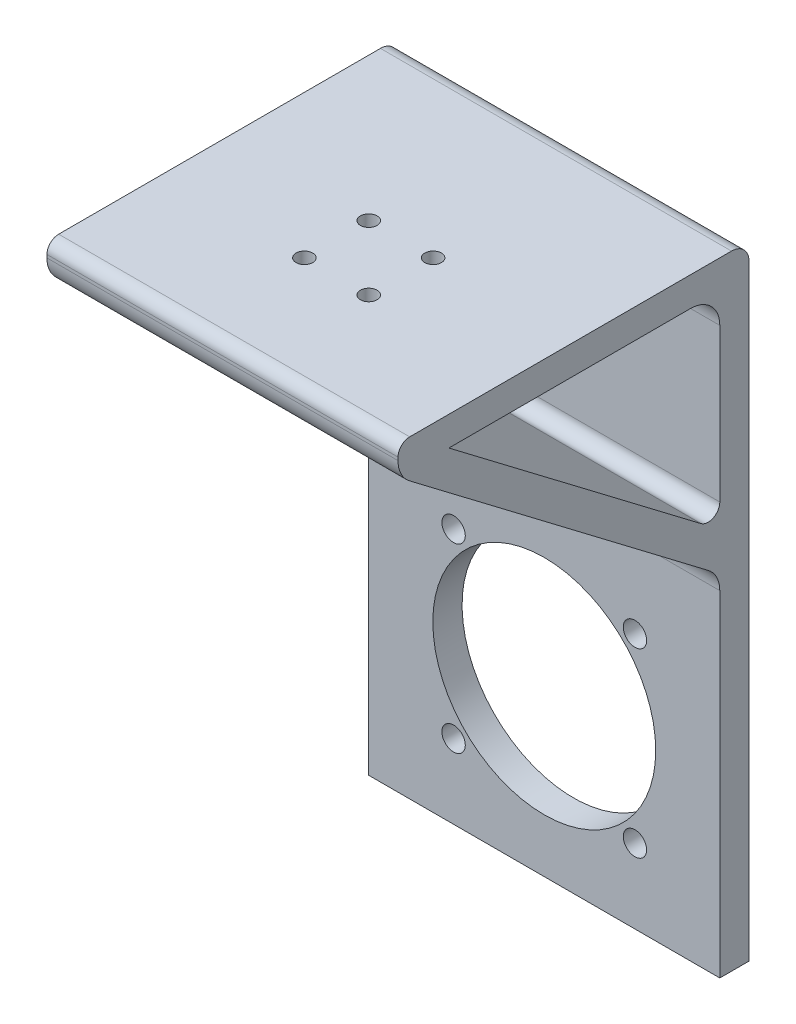
ISO-10303-21;
HEADER;
FILE_DESCRIPTION(('STEP AP214'),'2;1');
FILE_NAME('part.step','',(''),(''),'','','');
FILE_SCHEMA(('AUTOMOTIVE_DESIGN { 1 0 10303 214 1 1 1 1 }'));
ENDSEC;
DATA;
#1=APPLICATION_CONTEXT('core data for automotive mechanical design processes');
#2=APPLICATION_PROTOCOL_DEFINITION('international standard','automotive_design',2000,#1);
#3=PRODUCT_CONTEXT('',#1,'mechanical');
#4=PRODUCT('Part','Part','',(#3));
#5=PRODUCT_RELATED_PRODUCT_CATEGORY('part','',(#4));
#6=PRODUCT_DEFINITION_FORMATION('','',#4);
#7=PRODUCT_DEFINITION_CONTEXT('part definition',#1,'design');
#8=PRODUCT_DEFINITION('design','',#6,#7);
#9=PRODUCT_DEFINITION_SHAPE('','',#8);
#10=(LENGTH_UNIT() NAMED_UNIT(*) SI_UNIT(.MILLI.,.METRE.));
#11=(NAMED_UNIT(*) PLANE_ANGLE_UNIT() SI_UNIT($,.RADIAN.));
#12=(NAMED_UNIT(*) SI_UNIT($,.STERADIAN.) SOLID_ANGLE_UNIT());
#13=UNCERTAINTY_MEASURE_WITH_UNIT(LENGTH_MEASURE(1.E-05),#10,'distance_accuracy_value','');
#14=(GEOMETRIC_REPRESENTATION_CONTEXT(3) GLOBAL_UNCERTAINTY_ASSIGNED_CONTEXT((#13)) GLOBAL_UNIT_ASSIGNED_CONTEXT((#10,
#11,#12)) REPRESENTATION_CONTEXT('',''));
#15=CARTESIAN_POINT('',(0.,0.,0.));
#16=DIRECTION('',(0.,0.,1.));
#17=DIRECTION('',(1.,0.,0.));
#18=AXIS2_PLACEMENT_3D('',#15,#16,#17);
#19=CARTESIAN_POINT('',(-60.,-54.5050354164454,-34.5307356608479));
#20=DIRECTION('',(0.,0.,1.));
#21=DIRECTION('',(1.,0.,0.));
#22=AXIS2_PLACEMENT_3D('',#19,#20,#21);
#23=PLANE('',#22);
#24=CARTESIAN_POINT('',(-45.5,-10.8050354164454,-34.5307356608479));
#25=DIRECTION('',(0.,0.,1.));
#26=DIRECTION('',(1.,0.,0.));
#27=AXIS2_PLACEMENT_3D('',#24,#25,#26);
#28=CIRCLE('',#27,2.);
#29=CARTESIAN_POINT('',(-43.5,-10.8050354164454,-34.5307356608479));
#30=VERTEX_POINT('',#29);
#31=EDGE_CURVE('E416',#30,#30,#28,.F.);
#32=ORIENTED_EDGE('',*,*,#31,.T.);
#33=EDGE_LOOP('',(#32));
#34=FACE_BOUND('',#33,.T.);
#35=CARTESIAN_POINT('',(-45.5,-41.8050354164454,-34.5307356608479));
#36=DIRECTION('',(0.,0.,1.));
#37=DIRECTION('',(1.,0.,0.));
#38=AXIS2_PLACEMENT_3D('',#35,#36,#37);
#39=CIRCLE('',#38,2.);
#40=CARTESIAN_POINT('',(-43.5,-41.8050354164454,-34.5307356608479));
#41=VERTEX_POINT('',#40);
#42=EDGE_CURVE('E410',#41,#41,#39,.F.);
#43=ORIENTED_EDGE('',*,*,#42,.T.);
#44=EDGE_LOOP('',(#43));
#45=FACE_BOUND('',#44,.T.);
#46=CARTESIAN_POINT('',(-30.,-26.3050354164454,-34.5307356608479));
#47=DIRECTION('',(0.,0.,1.));
#48=DIRECTION('',(1.,0.,0.));
#49=AXIS2_PLACEMENT_3D('',#46,#47,#48);
#50=CIRCLE('',#49,19.05);
#51=CARTESIAN_POINT('',(-10.95,-26.3050354164454,-34.5307356608479));
#52=VERTEX_POINT('',#51);
#53=EDGE_CURVE('E397',#52,#52,#50,.F.);
#54=ORIENTED_EDGE('',*,*,#53,.T.);
#55=EDGE_LOOP('',(#54));
#56=FACE_BOUND('',#55,.T.);
#57=CARTESIAN_POINT('',(-14.5,-41.8050354164454,-34.5307356608479));
#58=DIRECTION('',(0.,0.,1.));
#59=DIRECTION('',(1.,0.,0.));
#60=AXIS2_PLACEMENT_3D('',#57,#58,#59);
#61=CIRCLE('',#60,2.);
#62=CARTESIAN_POINT('',(-12.5,-41.8050354164454,-34.5307356608479));
#63=VERTEX_POINT('',#62);
#64=EDGE_CURVE('E402',#63,#63,#61,.F.);
#65=ORIENTED_EDGE('',*,*,#64,.T.);
#66=EDGE_LOOP('',(#65));
#67=FACE_BOUND('',#66,.T.);
#68=CARTESIAN_POINT('',(-14.5,-10.8050354164454,-34.5307356608479));
#69=DIRECTION('',(0.,0.,1.));
#70=DIRECTION('',(1.,0.,0.));
#71=AXIS2_PLACEMENT_3D('',#68,#69,#70);
#72=CIRCLE('',#71,2.);
#73=CARTESIAN_POINT('',(-12.5,-10.8050354164454,-34.5307356608479));
#74=VERTEX_POINT('',#73);
#75=EDGE_CURVE('E415',#74,#74,#72,.F.);
#76=ORIENTED_EDGE('',*,*,#75,.T.);
#77=EDGE_LOOP('',(#76));
#78=FACE_BOUND('',#77,.T.);
#79=DIRECTION('',(0.,-1.,0.));
#80=VECTOR('',#79,1.);
#81=CARTESIAN_POINT('',(0.,-54.5050354164454,-34.5307356608479));
#82=LINE('',#81,#80);
#83=CARTESIAN_POINT('',(0.,2.83377955573048,-34.5307356608479));
#84=VERTEX_POINT('',#83);
#85=CARTESIAN_POINT('',(0.,-54.5050354164454,-34.5307356608479));
#86=VERTEX_POINT('',#85);
#87=EDGE_CURVE('E160',#84,#86,#82,.T.);
#88=ORIENTED_EDGE('',*,*,#87,.F.);
#89=DIRECTION('',(1.,0.,0.));
#90=VECTOR('',#89,1.);
#91=CARTESIAN_POINT('',(-60.,2.83377955573048,-34.5307356608479));
#92=LINE('',#91,#90);
#93=CARTESIAN_POINT('',(-60.,2.83377955573048,-34.5307356608479));
#94=VERTEX_POINT('',#93);
#95=EDGE_CURVE('E48',#84,#94,#92,.F.);
#96=ORIENTED_EDGE('',*,*,#95,.T.);
#97=DIRECTION('',(0.,-1.,0.));
#98=VECTOR('',#97,1.);
#99=CARTESIAN_POINT('',(-60.,-54.5050354164454,-34.5307356608479));
#100=LINE('',#99,#98);
#101=CARTESIAN_POINT('',(-60.,-54.5050354164454,-34.5307356608479));
#102=VERTEX_POINT('',#101);
#103=EDGE_CURVE('E175',#94,#102,#100,.T.);
#104=ORIENTED_EDGE('',*,*,#103,.T.);
#105=DIRECTION('',(1.,0.,0.));
#106=VECTOR('',#105,1.);
#107=CARTESIAN_POINT('',(-60.,-54.5050354164454,-34.5307356608479));
#108=LINE('',#107,#106);
#109=EDGE_CURVE('E191',#102,#86,#108,.T.);
#110=ORIENTED_EDGE('',*,*,#109,.T.);
#111=EDGE_LOOP('',(#88,#96,#104,#110));
#112=FACE_BOUND('',#111,.T.);
#113=ADVANCED_FACE('F33',(#34,#45,#56,#67,#78,#112),#23,.T.);
#114=CARTESIAN_POINT('',(-60.,5.31461249387864,-34.5307356608479));
#115=DIRECTION('',(0.,-0.796299213486143,0.60490293651242));
#116=DIRECTION('',(0.,-0.60490293651242,-0.796299213486143));
#117=AXIS2_PLACEMENT_3D('',#114,#115,#116);
#118=PLANE('',#117);
#119=DIRECTION('',(0.,-0.604902936512421,-0.796299213486144));
#120=VECTOR('',#119,1.);
#121=CARTESIAN_POINT('',(-60.,5.31461249387864,-34.5307356608479));
#122=LINE('',#121,#120);
#123=CARTESIAN_POINT('',(-60.,45.5943014542721,18.4937790217142));
#124=VERTEX_POINT('',#123);
#125=CARTESIAN_POINT('',(-60.,6.8152756231612,-32.55525034341));
#126=VERTEX_POINT('',#125);
#127=EDGE_CURVE('E188',#124,#126,#122,.T.);
#128=ORIENTED_EDGE('',*,*,#127,.T.);
#129=DIRECTION('',(1.,0.,0.));
#130=VECTOR('',#129,1.);
#131=CARTESIAN_POINT('',(0.,6.8152756231612,-32.55525034341));
#132=LINE('',#131,#130);
#133=CARTESIAN_POINT('',(0.,6.8152756231612,-32.55525034341));
#134=VERTEX_POINT('',#133);
#135=EDGE_CURVE('E254',#126,#134,#132,.T.);
#136=ORIENTED_EDGE('',*,*,#135,.T.);
#137=DIRECTION('',(0.,-0.604902936512421,-0.796299213486144));
#138=VECTOR('',#137,1.);
#139=CARTESIAN_POINT('',(0.,5.31461249387864,-34.5307356608479));
#140=LINE('',#139,#138);
#141=CARTESIAN_POINT('',(0.,45.5943014542721,18.4937790217142));
#142=VERTEX_POINT('',#141);
#143=EDGE_CURVE('E178',#142,#134,#140,.T.);
#144=ORIENTED_EDGE('',*,*,#143,.F.);
#145=DIRECTION('',(1.,0.,0.));
#146=VECTOR('',#145,1.);
#147=CARTESIAN_POINT('',(-60.,45.5943014542721,18.4937790217142));
#148=LINE('',#147,#146);
#149=EDGE_CURVE('E222',#142,#124,#148,.F.);
#150=ORIENTED_EDGE('',*,*,#149,.T.);
#151=EDGE_LOOP('',(#128,#136,#144,#150));
#152=FACE_BOUND('',#151,.T.);
#153=ADVANCED_FACE('F260',(#152),#118,.T.);
#154=CARTESIAN_POINT('',(-60.,47.0949645835546,20.4692643391521));
#155=DIRECTION('',(0.,0.,1.));
#156=DIRECTION('',(1.,0.,0.));
#157=AXIS2_PLACEMENT_3D('',#154,#155,#156);
#158=PLANE('',#157);
#159=DIRECTION('',(0.,-1.,0.));
#160=VECTOR('',#159,1.);
#161=CARTESIAN_POINT('',(0.,47.0949645835546,20.4692643391521));
#162=LINE('',#161,#160);
#163=CARTESIAN_POINT('',(0.,50.0949645835546,20.4692643391521));
#164=VERTEX_POINT('',#163);
#165=CARTESIAN_POINT('',(0.,49.5757975217028,20.4692643391521));
#166=VERTEX_POINT('',#165);
#167=EDGE_CURVE('E201',#164,#166,#162,.T.);
#168=ORIENTED_EDGE('',*,*,#167,.F.);
#169=DIRECTION('',(1.,0.,0.));
#170=VECTOR('',#169,1.);
#171=CARTESIAN_POINT('',(-60.,50.0949645835546,20.4692643391521));
#172=LINE('',#171,#170);
#173=CARTESIAN_POINT('',(-60.,50.0949645835546,20.4692643391521));
#174=VERTEX_POINT('',#173);
#175=EDGE_CURVE('E240',#164,#174,#172,.F.);
#176=ORIENTED_EDGE('',*,*,#175,.T.);
#177=DIRECTION('',(0.,-1.,0.));
#178=VECTOR('',#177,1.);
#179=CARTESIAN_POINT('',(-60.,47.0949645835546,20.4692643391521));
#180=LINE('',#179,#178);
#181=CARTESIAN_POINT('',(-60.,49.5757975217028,20.4692643391521));
#182=VERTEX_POINT('',#181);
#183=EDGE_CURVE('E186',#174,#182,#180,.T.);
#184=ORIENTED_EDGE('',*,*,#183,.T.);
#185=DIRECTION('',(1.,0.,0.));
#186=VECTOR('',#185,1.);
#187=CARTESIAN_POINT('',(-60.,49.5757975217028,20.4692643391521));
#188=LINE('',#187,#186);
#189=EDGE_CURVE('E217',#182,#166,#188,.T.);
#190=ORIENTED_EDGE('',*,*,#189,.T.);
#191=EDGE_LOOP('',(#168,#176,#184,#190));
#192=FACE_BOUND('',#191,.T.);
#193=ADVANCED_FACE('F273',(#192),#158,.T.);
#194=CARTESIAN_POINT('',(-60.,52.0949645835546,20.4692643391521));
#195=DIRECTION('',(0.,1.,0.));
#196=DIRECTION('',(0.,0.,1.));
#197=AXIS2_PLACEMENT_3D('',#194,#195,#196);
#198=PLANE('',#197);
#199=CARTESIAN_POINT('',(-35.5,52.0949645835546,0.969264339152152));
#200=DIRECTION('',(0.,1.,0.));
#201=DIRECTION('',(0.,0.,1.));
#202=AXIS2_PLACEMENT_3D('',#199,#200,#201);
#203=CIRCLE('',#202,1.425);
#204=CARTESIAN_POINT('',(-35.5,52.0949645835546,2.39426433915215));
#205=VERTEX_POINT('',#204);
#206=EDGE_CURVE('E426',#205,#205,#203,.T.);
#207=ORIENTED_EDGE('',*,*,#206,.F.);
#208=EDGE_LOOP('',(#207));
#209=FACE_BOUND('',#208,.T.);
#210=CARTESIAN_POINT('',(-24.5,52.0949645835546,0.969264339152152));
#211=DIRECTION('',(0.,1.,0.));
#212=DIRECTION('',(0.,0.,1.));
#213=AXIS2_PLACEMENT_3D('',#210,#211,#212);
#214=CIRCLE('',#213,1.425);
#215=CARTESIAN_POINT('',(-24.5,52.0949645835546,2.39426433915215));
#216=VERTEX_POINT('',#215);
#217=EDGE_CURVE('E437',#216,#216,#214,.T.);
#218=ORIENTED_EDGE('',*,*,#217,.F.);
#219=EDGE_LOOP('',(#218));
#220=FACE_BOUND('',#219,.T.);
#221=CARTESIAN_POINT('',(-24.5,52.0949645835546,-10.0307356608478));
#222=DIRECTION('',(0.,1.,0.));
#223=DIRECTION('',(0.,0.,1.));
#224=AXIS2_PLACEMENT_3D('',#221,#222,#223);
#225=CIRCLE('',#224,1.425);
#226=CARTESIAN_POINT('',(-24.5,52.0949645835546,-8.60573566084785));
#227=VERTEX_POINT('',#226);
#228=EDGE_CURVE('E429',#227,#227,#225,.T.);
#229=ORIENTED_EDGE('',*,*,#228,.F.);
#230=EDGE_LOOP('',(#229));
#231=FACE_BOUND('',#230,.T.);
#232=CARTESIAN_POINT('',(-35.5,52.0949645835546,-10.0307356608478));
#233=DIRECTION('',(0.,1.,0.));
#234=DIRECTION('',(0.,0.,1.));
#235=AXIS2_PLACEMENT_3D('',#232,#233,#234);
#236=CIRCLE('',#235,1.425);
#237=CARTESIAN_POINT('',(-35.5,52.0949645835546,-8.60573566084785));
#238=VERTEX_POINT('',#237);
#239=EDGE_CURVE('E436',#238,#238,#236,.T.);
#240=ORIENTED_EDGE('',*,*,#239,.F.);
#241=EDGE_LOOP('',(#240));
#242=FACE_BOUND('',#241,.T.);
#243=DIRECTION('',(0.,0.,1.));
#244=VECTOR('',#243,1.);
#245=CARTESIAN_POINT('',(0.,52.0949645835546,20.4692643391521));
#246=LINE('',#245,#244);
#247=CARTESIAN_POINT('',(0.,52.0949645835546,-36.5307356608478));
#248=VERTEX_POINT('',#247);
#249=CARTESIAN_POINT('',(0.,52.0949645835546,18.4692643391521));
#250=VERTEX_POINT('',#249);
#251=EDGE_CURVE('E199',#248,#250,#246,.T.);
#252=ORIENTED_EDGE('',*,*,#251,.F.);
#253=DIRECTION('',(1.,0.,0.));
#254=VECTOR('',#253,1.);
#255=CARTESIAN_POINT('',(-60.,52.0949645835546,-36.5307356608479));
#256=LINE('',#255,#254);
#257=CARTESIAN_POINT('',(-60.,52.0949645835546,-36.5307356608478));
#258=VERTEX_POINT('',#257);
#259=EDGE_CURVE('E250',#248,#258,#256,.F.);
#260=ORIENTED_EDGE('',*,*,#259,.T.);
#261=DIRECTION('',(0.,0.,1.));
#262=VECTOR('',#261,1.);
#263=CARTESIAN_POINT('',(-60.,52.0949645835546,20.4692643391521));
#264=LINE('',#263,#262);
#265=CARTESIAN_POINT('',(-60.,52.0949645835546,18.4692643391521));
#266=VERTEX_POINT('',#265);
#267=EDGE_CURVE('E184',#258,#266,#264,.T.);
#268=ORIENTED_EDGE('',*,*,#267,.T.);
#269=DIRECTION('',(1.,0.,0.));
#270=VECTOR('',#269,1.);
#271=CARTESIAN_POINT('',(-60.,52.0949645835546,18.4692643391521));
#272=LINE('',#271,#270);
#273=EDGE_CURVE('E235',#266,#250,#272,.T.);
#274=ORIENTED_EDGE('',*,*,#273,.T.);
#275=EDGE_LOOP('',(#252,#260,#268,#274));
#276=FACE_BOUND('',#275,.T.);
#277=ADVANCED_FACE('F334',(#209,#220,#231,#242,#276),#198,.T.);
#278=CARTESIAN_POINT('',(-60.,52.0949645835546,-39.5307356608479));
#279=DIRECTION('',(0.,0.,-1.));
#280=DIRECTION('',(0.,1.,0.));
#281=AXIS2_PLACEMENT_3D('',#278,#279,#280);
#282=PLANE('',#281);
#283=CARTESIAN_POINT('',(-45.5,-10.8050354164454,-39.5307356608479));
#284=DIRECTION('',(0.,0.,-1.));
#285=DIRECTION('',(0.,1.,0.));
#286=AXIS2_PLACEMENT_3D('',#283,#284,#285);
#287=CIRCLE('',#286,2.);
#288=CARTESIAN_POINT('',(-45.5,-8.80503541644536,-39.5307356608479));
#289=VERTEX_POINT('',#288);
#290=EDGE_CURVE('E412',#289,#289,#287,.T.);
#291=ORIENTED_EDGE('',*,*,#290,.F.);
#292=EDGE_LOOP('',(#291));
#293=FACE_BOUND('',#292,.T.);
#294=CARTESIAN_POINT('',(-45.5,-41.8050354164454,-39.5307356608479));
#295=DIRECTION('',(0.,0.,-1.));
#296=DIRECTION('',(0.,1.,0.));
#297=AXIS2_PLACEMENT_3D('',#294,#295,#296);
#298=CIRCLE('',#297,2.);
#299=CARTESIAN_POINT('',(-45.5,-39.8050354164454,-39.5307356608479));
#300=VERTEX_POINT('',#299);
#301=EDGE_CURVE('E418',#300,#300,#298,.T.);
#302=ORIENTED_EDGE('',*,*,#301,.F.);
#303=EDGE_LOOP('',(#302));
#304=FACE_BOUND('',#303,.T.);
#305=CARTESIAN_POINT('',(-30.,-26.3050354164454,-39.5307356608479));
#306=DIRECTION('',(0.,0.,-1.));
#307=DIRECTION('',(0.,1.,0.));
#308=AXIS2_PLACEMENT_3D('',#305,#306,#307);
#309=CIRCLE('',#308,19.05);
#310=CARTESIAN_POINT('',(-30.,-7.25503541644536,-39.5307356608479));
#311=VERTEX_POINT('',#310);
#312=EDGE_CURVE('E400',#311,#311,#309,.T.);
#313=ORIENTED_EDGE('',*,*,#312,.F.);
#314=EDGE_LOOP('',(#313));
#315=FACE_BOUND('',#314,.T.);
#316=CARTESIAN_POINT('',(-14.5,-41.8050354164454,-39.5307356608479));
#317=DIRECTION('',(0.,0.,-1.));
#318=DIRECTION('',(0.,1.,0.));
#319=AXIS2_PLACEMENT_3D('',#316,#317,#318);
#320=CIRCLE('',#319,2.);
#321=CARTESIAN_POINT('',(-14.5,-39.8050354164454,-39.5307356608479));
#322=VERTEX_POINT('',#321);
#323=EDGE_CURVE('E405',#322,#322,#320,.T.);
#324=ORIENTED_EDGE('',*,*,#323,.F.);
#325=EDGE_LOOP('',(#324));
#326=FACE_BOUND('',#325,.T.);
#327=CARTESIAN_POINT('',(-14.5,-10.8050354164454,-39.5307356608479));
#328=DIRECTION('',(0.,0.,-1.));
#329=DIRECTION('',(0.,1.,0.));
#330=AXIS2_PLACEMENT_3D('',#327,#328,#329);
#331=CIRCLE('',#330,2.);
#332=CARTESIAN_POINT('',(-14.5,-8.80503541644537,-39.5307356608479));
#333=VERTEX_POINT('',#332);
#334=EDGE_CURVE('E423',#333,#333,#331,.T.);
#335=ORIENTED_EDGE('',*,*,#334,.F.);
#336=EDGE_LOOP('',(#335));
#337=FACE_BOUND('',#336,.T.);
#338=DIRECTION('',(0.,1.,0.));
#339=VECTOR('',#338,1.);
#340=CARTESIAN_POINT('',(-60.,52.0949645835546,-39.5307356608479));
#341=LINE('',#340,#339);
#342=CARTESIAN_POINT('',(-60.,-54.5050354164454,-39.5307356608479));
#343=VERTEX_POINT('',#342);
#344=CARTESIAN_POINT('',(-60.,49.0949645835546,-39.5307356608479));
#345=VERTEX_POINT('',#344);
#346=EDGE_CURVE('E181',#343,#345,#341,.T.);
#347=ORIENTED_EDGE('',*,*,#346,.T.);
#348=DIRECTION('',(1.,0.,0.));
#349=VECTOR('',#348,1.);
#350=CARTESIAN_POINT('',(-60.,49.0949645835546,-39.5307356608479));
#351=LINE('',#350,#349);
#352=CARTESIAN_POINT('',(0.,49.0949645835546,-39.5307356608479));
#353=VERTEX_POINT('',#352);
#354=EDGE_CURVE('E245',#345,#353,#351,.T.);
#355=ORIENTED_EDGE('',*,*,#354,.T.);
#356=DIRECTION('',(0.,1.,0.));
#357=VECTOR('',#356,1.);
#358=CARTESIAN_POINT('',(0.,52.0949645835546,-39.5307356608479));
#359=LINE('',#358,#357);
#360=CARTESIAN_POINT('',(0.,-54.5050354164454,-39.5307356608479));
#361=VERTEX_POINT('',#360);
#362=EDGE_CURVE('E196',#361,#353,#359,.T.);
#363=ORIENTED_EDGE('',*,*,#362,.F.);
#364=DIRECTION('',(1.,0.,0.));
#365=VECTOR('',#364,1.);
#366=CARTESIAN_POINT('',(-60.,-54.5050354164454,-39.5307356608479));
#367=LINE('',#366,#365);
#368=EDGE_CURVE('E204',#343,#361,#367,.T.);
#369=ORIENTED_EDGE('',*,*,#368,.F.);
#370=EDGE_LOOP('',(#347,#355,#363,#369));
#371=FACE_BOUND('',#370,.T.);
#372=ADVANCED_FACE('F323',(#293,#304,#315,#326,#337,#371),#282,.T.);
#373=CARTESIAN_POINT('',(-60.,-54.5050354164454,-39.5307356608479));
#374=DIRECTION('',(0.,-1.,0.));
#375=DIRECTION('',(0.,0.,-1.));
#376=AXIS2_PLACEMENT_3D('',#373,#374,#375);
#377=PLANE('',#376);
#378=DIRECTION('',(0.,0.,-1.));
#379=VECTOR('',#378,1.);
#380=CARTESIAN_POINT('',(0.,-54.5050354164454,-39.5307356608479));
#381=LINE('',#380,#379);
#382=EDGE_CURVE('E193',#86,#361,#381,.T.);
#383=ORIENTED_EDGE('',*,*,#382,.F.);
#384=ORIENTED_EDGE('',*,*,#109,.F.);
#385=DIRECTION('',(0.,0.,-1.));
#386=VECTOR('',#385,1.);
#387=CARTESIAN_POINT('',(-60.,-54.5050354164454,-39.5307356608479));
#388=LINE('',#387,#386);
#389=EDGE_CURVE('E177',#102,#343,#388,.T.);
#390=ORIENTED_EDGE('',*,*,#389,.T.);
#391=ORIENTED_EDGE('',*,*,#368,.T.);
#392=EDGE_LOOP('',(#383,#384,#390,#391));
#393=FACE_BOUND('',#392,.T.);
#394=ADVANCED_FACE('F297',(#393),#377,.T.);
#395=CARTESIAN_POINT('',(-60.,0.,0.));
#396=DIRECTION('',(-1.,0.,0.));
#397=DIRECTION('',(0.,0.,1.));
#398=AXIS2_PLACEMENT_3D('',#395,#396,#397);
#399=PLANE('',#398);
#400=DIRECTION('',(0.,-0.60490293651242,-0.796299213486143));
#401=VECTOR('',#400,1.);
#402=CARTESIAN_POINT('',(-60.,47.0949645835546,11.7725687195789));
#403=LINE('',#402,#401);
#404=CARTESIAN_POINT('',(-60.,47.0949645835546,11.7725687195789));
#405=VERTEX_POINT('',#404);
#406=CARTESIAN_POINT('',(-60.,14.3593002123696,-31.320929787823));
#407=VERTEX_POINT('',#406);
#408=EDGE_CURVE('E143',#405,#407,#403,.T.);
#409=ORIENTED_EDGE('',*,*,#408,.T.);
#410=CARTESIAN_POINT('',(-60.,15.9518986393419,-32.5307356608479));
#411=DIRECTION('',(-1.,0.,0.));
#412=DIRECTION('',(0.,0.,1.));
#413=AXIS2_PLACEMENT_3D('',#410,#411,#412);
#414=CIRCLE('',#413,2.);
#415=CARTESIAN_POINT('',(-60.,15.9518986393419,-34.5307356608479));
#416=VERTEX_POINT('',#415);
#417=EDGE_CURVE('E233',#407,#416,#414,.F.);
#418=ORIENTED_EDGE('',*,*,#417,.T.);
#419=DIRECTION('',(0.,1.,0.));
#420=VECTOR('',#419,1.);
#421=CARTESIAN_POINT('',(-60.,11.9209944030153,-34.5307356608479));
#422=LINE('',#421,#420);
#423=CARTESIAN_POINT('',(-60.,42.0949645835546,-34.5307356608479));
#424=VERTEX_POINT('',#423);
#425=EDGE_CURVE('E161',#416,#424,#422,.T.);
#426=ORIENTED_EDGE('',*,*,#425,.T.);
#427=CARTESIAN_POINT('',(-60.,42.0949645835546,-29.5307356608479));
#428=DIRECTION('',(-1.,0.,0.));
#429=DIRECTION('',(0.,0.,1.));
#430=AXIS2_PLACEMENT_3D('',#427,#428,#429);
#431=CIRCLE('',#430,5.);
#432=CARTESIAN_POINT('',(-60.,47.0949645835546,-29.5307356608479));
#433=VERTEX_POINT('',#432);
#434=EDGE_CURVE('E146',#424,#433,#431,.F.);
#435=ORIENTED_EDGE('',*,*,#434,.T.);
#436=DIRECTION('',(0.,0.,1.));
#437=VECTOR('',#436,1.);
#438=CARTESIAN_POINT('',(-60.,47.0949645835546,-34.5307356608479));
#439=LINE('',#438,#437);
#440=EDGE_CURVE('E138',#433,#405,#439,.T.);
#441=ORIENTED_EDGE('',*,*,#440,.T.);
#442=EDGE_LOOP('',(#409,#418,#426,#435,#441));
#443=FACE_BOUND('',#442,.T.);
#444=ORIENTED_EDGE('',*,*,#267,.F.);
#445=CARTESIAN_POINT('',(-60.,49.0949645835546,-36.5307356608479));
#446=DIRECTION('',(-1.,0.,0.));
#447=DIRECTION('',(0.,0.,1.));
#448=AXIS2_PLACEMENT_3D('',#445,#446,#447);
#449=CIRCLE('',#448,3.);
#450=EDGE_CURVE('E252',#258,#345,#449,.T.);
#451=ORIENTED_EDGE('',*,*,#450,.T.);
#452=ORIENTED_EDGE('',*,*,#346,.F.);
#453=ORIENTED_EDGE('',*,*,#389,.F.);
#454=ORIENTED_EDGE('',*,*,#103,.F.);
#455=CARTESIAN_POINT('',(-60.,2.83377955573048,-29.5307356608479));
#456=DIRECTION('',(-1.,0.,0.));
#457=DIRECTION('',(0.,0.,1.));
#458=AXIS2_PLACEMENT_3D('',#455,#456,#457);
#459=CIRCLE('',#458,5.);
#460=EDGE_CURVE('E11',#94,#126,#459,.F.);
#461=ORIENTED_EDGE('',*,*,#460,.T.);
#462=ORIENTED_EDGE('',*,*,#127,.F.);
#463=CARTESIAN_POINT('',(-60.,49.5757975217028,15.4692643391521));
#464=DIRECTION('',(-1.,0.,0.));
#465=DIRECTION('',(0.,0.,1.));
#466=AXIS2_PLACEMENT_3D('',#463,#464,#465);
#467=CIRCLE('',#466,5.);
#468=EDGE_CURVE('E224',#124,#182,#467,.T.);
#469=ORIENTED_EDGE('',*,*,#468,.T.);
#470=ORIENTED_EDGE('',*,*,#183,.F.);
#471=CARTESIAN_POINT('',(-60.,50.0949645835546,18.4692643391521));
#472=DIRECTION('',(-1.,0.,0.));
#473=DIRECTION('',(0.,0.,1.));
#474=AXIS2_PLACEMENT_3D('',#471,#472,#473);
#475=CIRCLE('',#474,2.);
#476=EDGE_CURVE('E242',#174,#266,#475,.T.);
#477=ORIENTED_EDGE('',*,*,#476,.T.);
#478=EDGE_LOOP('',(#444,#451,#452,#453,#454,#461,#462,#469,#470,#477));
#479=FACE_BOUND('',#478,.T.);
#480=ADVANCED_FACE('F140',(#443,#479),#399,.T.);
#481=CARTESIAN_POINT('',(0.,0.,0.));
#482=DIRECTION('',(-1.,0.,0.));
#483=DIRECTION('',(0.,0.,1.));
#484=AXIS2_PLACEMENT_3D('',#481,#482,#483);
#485=PLANE('',#484);
#486=DIRECTION('',(0.,-0.60490293651242,-0.796299213486143));
#487=VECTOR('',#486,1.);
#488=CARTESIAN_POINT('',(0.,47.0949645835546,11.7725687195789));
#489=LINE('',#488,#487);
#490=CARTESIAN_POINT('',(0.,47.0949645835546,11.7725687195788));
#491=VERTEX_POINT('',#490);
#492=CARTESIAN_POINT('',(0.,14.3593002123696,-31.320929787823));
#493=VERTEX_POINT('',#492);
#494=EDGE_CURVE('E171',#491,#493,#489,.T.);
#495=ORIENTED_EDGE('',*,*,#494,.F.);
#496=DIRECTION('',(0.,0.,1.));
#497=VECTOR('',#496,1.);
#498=CARTESIAN_POINT('',(0.,47.0949645835546,-34.5307356608479));
#499=LINE('',#498,#497);
#500=CARTESIAN_POINT('',(0.,47.0949645835546,-29.5307356608479));
#501=VERTEX_POINT('',#500);
#502=EDGE_CURVE('E156',#501,#491,#499,.T.);
#503=ORIENTED_EDGE('',*,*,#502,.F.);
#504=CARTESIAN_POINT('',(0.,42.0949645835546,-29.5307356608479));
#505=DIRECTION('',(-1.,0.,0.));
#506=DIRECTION('',(0.,0.,1.));
#507=AXIS2_PLACEMENT_3D('',#504,#505,#506);
#508=CIRCLE('',#507,5.);
#509=CARTESIAN_POINT('',(0.,42.0949645835546,-34.5307356608479));
#510=VERTEX_POINT('',#509);
#511=EDGE_CURVE('E213',#501,#510,#508,.T.);
#512=ORIENTED_EDGE('',*,*,#511,.T.);
#513=DIRECTION('',(0.,1.,0.));
#514=VECTOR('',#513,1.);
#515=CARTESIAN_POINT('',(0.,11.9209944030153,-34.5307356608479));
#516=LINE('',#515,#514);
#517=CARTESIAN_POINT('',(0.,15.9518986393419,-34.5307356608479));
#518=VERTEX_POINT('',#517);
#519=EDGE_CURVE('E150',#518,#510,#516,.T.);
#520=ORIENTED_EDGE('',*,*,#519,.F.);
#521=CARTESIAN_POINT('',(0.,15.9518986393419,-32.5307356608479));
#522=DIRECTION('',(-1.,0.,0.));
#523=DIRECTION('',(0.,0.,1.));
#524=AXIS2_PLACEMENT_3D('',#521,#522,#523);
#525=CIRCLE('',#524,2.);
#526=EDGE_CURVE('E231',#518,#493,#525,.T.);
#527=ORIENTED_EDGE('',*,*,#526,.T.);
#528=EDGE_LOOP('',(#495,#503,#512,#520,#527));
#529=FACE_BOUND('',#528,.T.);
#530=ORIENTED_EDGE('',*,*,#362,.T.);
#531=CARTESIAN_POINT('',(0.,49.0949645835546,-36.5307356608479));
#532=DIRECTION('',(-1.,0.,0.));
#533=DIRECTION('',(0.,0.,1.));
#534=AXIS2_PLACEMENT_3D('',#531,#532,#533);
#535=CIRCLE('',#534,3.);
#536=EDGE_CURVE('E248',#353,#248,#535,.F.);
#537=ORIENTED_EDGE('',*,*,#536,.T.);
#538=ORIENTED_EDGE('',*,*,#251,.T.);
#539=CARTESIAN_POINT('',(0.,50.0949645835546,18.4692643391521));
#540=DIRECTION('',(-1.,0.,0.));
#541=DIRECTION('',(0.,0.,1.));
#542=AXIS2_PLACEMENT_3D('',#539,#540,#541);
#543=CIRCLE('',#542,2.);
#544=EDGE_CURVE('E238',#250,#164,#543,.F.);
#545=ORIENTED_EDGE('',*,*,#544,.T.);
#546=ORIENTED_EDGE('',*,*,#167,.T.);
#547=CARTESIAN_POINT('',(0.,49.5757975217028,15.4692643391521));
#548=DIRECTION('',(-1.,0.,0.));
#549=DIRECTION('',(0.,0.,1.));
#550=AXIS2_PLACEMENT_3D('',#547,#548,#549);
#551=CIRCLE('',#550,5.);
#552=EDGE_CURVE('E220',#166,#142,#551,.F.);
#553=ORIENTED_EDGE('',*,*,#552,.T.);
#554=ORIENTED_EDGE('',*,*,#143,.T.);
#555=CARTESIAN_POINT('',(0.,2.83377955573048,-29.5307356608479));
#556=DIRECTION('',(-1.,0.,0.));
#557=DIRECTION('',(0.,0.,1.));
#558=AXIS2_PLACEMENT_3D('',#555,#556,#557);
#559=CIRCLE('',#558,5.);
#560=EDGE_CURVE('E41',#134,#84,#559,.T.);
#561=ORIENTED_EDGE('',*,*,#560,.T.);
#562=ORIENTED_EDGE('',*,*,#87,.T.);
#563=ORIENTED_EDGE('',*,*,#382,.T.);
#564=EDGE_LOOP('',(#530,#537,#538,#545,#546,#553,#554,#561,#562,#563));
#565=FACE_BOUND('',#564,.T.);
#566=ADVANCED_FACE('F265',(#529,#565),#485,.F.);
#567=CARTESIAN_POINT('',(-60.,47.0949645835546,-34.5307356608479));
#568=DIRECTION('',(0.,1.,0.));
#569=DIRECTION('',(0.,0.,1.));
#570=AXIS2_PLACEMENT_3D('',#567,#568,#569);
#571=PLANE('',#570);
#572=CARTESIAN_POINT('',(-35.5,47.0949645835546,0.969264339152152));
#573=DIRECTION('',(0.,1.,0.));
#574=DIRECTION('',(0.,0.,1.));
#575=AXIS2_PLACEMENT_3D('',#572,#573,#574);
#576=CIRCLE('',#575,1.425);
#577=CARTESIAN_POINT('',(-35.5,47.0949645835546,2.39426433915215));
#578=VERTEX_POINT('',#577);
#579=EDGE_CURVE('E440',#578,#578,#576,.F.);
#580=ORIENTED_EDGE('',*,*,#579,.F.);
#581=EDGE_LOOP('',(#580));
#582=FACE_BOUND('',#581,.T.);
#583=CARTESIAN_POINT('',(-24.5,47.0949645835546,0.969264339152152));
#584=DIRECTION('',(0.,1.,0.));
#585=DIRECTION('',(0.,0.,1.));
#586=AXIS2_PLACEMENT_3D('',#583,#584,#585);
#587=CIRCLE('',#586,1.425);
#588=CARTESIAN_POINT('',(-24.5,47.0949645835546,2.39426433915215));
#589=VERTEX_POINT('',#588);
#590=EDGE_CURVE('E433',#589,#589,#587,.F.);
#591=ORIENTED_EDGE('',*,*,#590,.F.);
#592=EDGE_LOOP('',(#591));
#593=FACE_BOUND('',#592,.T.);
#594=CARTESIAN_POINT('',(-24.5,47.0949645835546,-10.0307356608478));
#595=DIRECTION('',(0.,1.,0.));
#596=DIRECTION('',(0.,0.,1.));
#597=AXIS2_PLACEMENT_3D('',#594,#595,#596);
#598=CIRCLE('',#597,1.425);
#599=CARTESIAN_POINT('',(-24.5,47.0949645835546,-8.60573566084785));
#600=VERTEX_POINT('',#599);
#601=EDGE_CURVE('E432',#600,#600,#598,.F.);
#602=ORIENTED_EDGE('',*,*,#601,.F.);
#603=EDGE_LOOP('',(#602));
#604=FACE_BOUND('',#603,.T.);
#605=CARTESIAN_POINT('',(-35.5,47.0949645835546,-10.0307356608478));
#606=DIRECTION('',(0.,1.,0.));
#607=DIRECTION('',(0.,0.,1.));
#608=AXIS2_PLACEMENT_3D('',#605,#606,#607);
#609=CIRCLE('',#608,1.425);
#610=CARTESIAN_POINT('',(-35.5,47.0949645835546,-8.60573566084785));
#611=VERTEX_POINT('',#610);
#612=EDGE_CURVE('E172',#611,#611,#609,.F.);
#613=ORIENTED_EDGE('',*,*,#612,.F.);
#614=EDGE_LOOP('',(#613));
#615=FACE_BOUND('',#614,.T.);
#616=ORIENTED_EDGE('',*,*,#440,.F.);
#617=DIRECTION('',(1.,0.,0.));
#618=VECTOR('',#617,1.);
#619=CARTESIAN_POINT('',(0.,47.0949645835546,-29.5307356608479));
#620=LINE('',#619,#618);
#621=EDGE_CURVE('E206',#433,#501,#620,.T.);
#622=ORIENTED_EDGE('',*,*,#621,.T.);
#623=ORIENTED_EDGE('',*,*,#502,.T.);
#624=DIRECTION('',(1.,0.,0.));
#625=VECTOR('',#624,1.);
#626=CARTESIAN_POINT('',(-60.,47.0949645835546,11.7725687195789));
#627=LINE('',#626,#625);
#628=EDGE_CURVE('E153',#405,#491,#627,.T.);
#629=ORIENTED_EDGE('',*,*,#628,.F.);
#630=EDGE_LOOP('',(#616,#622,#623,#629));
#631=FACE_BOUND('',#630,.T.);
#632=ADVANCED_FACE('F154',(#582,#593,#604,#615,#631),#571,.F.);
#633=CARTESIAN_POINT('',(-60.,11.9209944030153,-34.5307356608479));
#634=DIRECTION('',(0.,0.,-1.));
#635=DIRECTION('',(-1.,0.,0.));
#636=AXIS2_PLACEMENT_3D('',#633,#634,#635);
#637=PLANE('',#636);
#638=ORIENTED_EDGE('',*,*,#425,.F.);
#639=DIRECTION('',(1.,0.,0.));
#640=VECTOR('',#639,1.);
#641=CARTESIAN_POINT('',(0.,15.9518986393419,-34.5307356608479));
#642=LINE('',#641,#640);
#643=EDGE_CURVE('E227',#416,#518,#642,.T.);
#644=ORIENTED_EDGE('',*,*,#643,.T.);
#645=ORIENTED_EDGE('',*,*,#519,.T.);
#646=DIRECTION('',(1.,0.,0.));
#647=VECTOR('',#646,1.);
#648=CARTESIAN_POINT('',(-60.,42.0949645835546,-34.5307356608479));
#649=LINE('',#648,#647);
#650=EDGE_CURVE('E210',#510,#424,#649,.F.);
#651=ORIENTED_EDGE('',*,*,#650,.T.);
#652=EDGE_LOOP('',(#638,#644,#645,#651));
#653=FACE_BOUND('',#652,.T.);
#654=ADVANCED_FACE('F351',(#653),#637,.F.);
#655=CARTESIAN_POINT('',(-60.,47.0949645835546,11.7725687195789));
#656=DIRECTION('',(0.,-0.796299213486144,0.60490293651242));
#657=DIRECTION('',(0.,-0.60490293651242,-0.796299213486144));
#658=AXIS2_PLACEMENT_3D('',#655,#656,#657);
#659=PLANE('',#658);
#660=ORIENTED_EDGE('',*,*,#494,.T.);
#661=DIRECTION('',(1.,0.,0.));
#662=VECTOR('',#661,1.);
#663=CARTESIAN_POINT('',(-60.,14.3593002123696,-31.320929787823));
#664=LINE('',#663,#662);
#665=EDGE_CURVE('E165',#493,#407,#664,.F.);
#666=ORIENTED_EDGE('',*,*,#665,.T.);
#667=ORIENTED_EDGE('',*,*,#408,.F.);
#668=ORIENTED_EDGE('',*,*,#628,.T.);
#669=EDGE_LOOP('',(#660,#666,#667,#668));
#670=FACE_BOUND('',#669,.T.);
#671=ADVANCED_FACE('F163',(#670),#659,.F.);
#672=CARTESIAN_POINT('',(-35.5,-54.5060354164454,-10.0307356608478));
#673=DIRECTION('',(0.,1.,0.));
#674=DIRECTION('',(0.,0.,1.));
#675=AXIS2_PLACEMENT_3D('',#672,#673,#674);
#676=CYLINDRICAL_SURFACE('',#675,1.425);
#677=ORIENTED_EDGE('',*,*,#239,.T.);
#678=EDGE_LOOP('',(#677));
#679=FACE_BOUND('',#678,.T.);
#680=ORIENTED_EDGE('',*,*,#612,.T.);
#681=EDGE_LOOP('',(#680));
#682=FACE_BOUND('',#681,.T.);
#683=ADVANCED_FACE('F355',(#679,#682),#676,.F.);
#684=CARTESIAN_POINT('',(-24.5,-54.5060354164454,-10.0307356608478));
#685=DIRECTION('',(0.,1.,0.));
#686=DIRECTION('',(0.,0.,1.));
#687=AXIS2_PLACEMENT_3D('',#684,#685,#686);
#688=CYLINDRICAL_SURFACE('',#687,1.425);
#689=ORIENTED_EDGE('',*,*,#228,.T.);
#690=EDGE_LOOP('',(#689));
#691=FACE_BOUND('',#690,.T.);
#692=ORIENTED_EDGE('',*,*,#601,.T.);
#693=EDGE_LOOP('',(#692));
#694=FACE_BOUND('',#693,.T.);
#695=ADVANCED_FACE('F361',(#691,#694),#688,.F.);
#696=CARTESIAN_POINT('',(-24.5,-54.5060354164454,0.969264339152152));
#697=DIRECTION('',(0.,1.,0.));
#698=DIRECTION('',(0.,0.,1.));
#699=AXIS2_PLACEMENT_3D('',#696,#697,#698);
#700=CYLINDRICAL_SURFACE('',#699,1.425);
#701=ORIENTED_EDGE('',*,*,#217,.T.);
#702=EDGE_LOOP('',(#701));
#703=FACE_BOUND('',#702,.T.);
#704=ORIENTED_EDGE('',*,*,#590,.T.);
#705=EDGE_LOOP('',(#704));
#706=FACE_BOUND('',#705,.T.);
#707=ADVANCED_FACE('F367',(#703,#706),#700,.F.);
#708=CARTESIAN_POINT('',(-35.5,-54.5060354164454,0.969264339152152));
#709=DIRECTION('',(0.,1.,0.));
#710=DIRECTION('',(0.,0.,1.));
#711=AXIS2_PLACEMENT_3D('',#708,#709,#710);
#712=CYLINDRICAL_SURFACE('',#711,1.425);
#713=ORIENTED_EDGE('',*,*,#206,.T.);
#714=EDGE_LOOP('',(#713));
#715=FACE_BOUND('',#714,.T.);
#716=ORIENTED_EDGE('',*,*,#579,.T.);
#717=EDGE_LOOP('',(#716));
#718=FACE_BOUND('',#717,.T.);
#719=ADVANCED_FACE('F363',(#715,#718),#712,.F.);
#720=CARTESIAN_POINT('',(-14.5,-10.8050354164454,20.4702643391521));
#721=DIRECTION('',(0.,0.,-1.));
#722=DIRECTION('',(0.,1.,0.));
#723=AXIS2_PLACEMENT_3D('',#720,#721,#722);
#724=CYLINDRICAL_SURFACE('',#723,2.);
#725=ORIENTED_EDGE('',*,*,#75,.F.);
#726=EDGE_LOOP('',(#725));
#727=FACE_BOUND('',#726,.T.);
#728=ORIENTED_EDGE('',*,*,#334,.T.);
#729=EDGE_LOOP('',(#728));
#730=FACE_BOUND('',#729,.T.);
#731=ADVANCED_FACE('F366',(#727,#730),#724,.F.);
#732=CARTESIAN_POINT('',(-14.5,-41.8050354164454,20.4702643391521));
#733=DIRECTION('',(0.,0.,-1.));
#734=DIRECTION('',(0.,1.,0.));
#735=AXIS2_PLACEMENT_3D('',#732,#733,#734);
#736=CYLINDRICAL_SURFACE('',#735,2.);
#737=ORIENTED_EDGE('',*,*,#64,.F.);
#738=EDGE_LOOP('',(#737));
#739=FACE_BOUND('',#738,.T.);
#740=ORIENTED_EDGE('',*,*,#323,.T.);
#741=EDGE_LOOP('',(#740));
#742=FACE_BOUND('',#741,.T.);
#743=ADVANCED_FACE('F377',(#739,#742),#736,.F.);
#744=CARTESIAN_POINT('',(-30.,-26.3050354164454,20.4702643391521));
#745=DIRECTION('',(0.,0.,-1.));
#746=DIRECTION('',(0.,1.,0.));
#747=AXIS2_PLACEMENT_3D('',#744,#745,#746);
#748=CYLINDRICAL_SURFACE('',#747,19.05);
#749=ORIENTED_EDGE('',*,*,#53,.F.);
#750=EDGE_LOOP('',(#749));
#751=FACE_BOUND('',#750,.T.);
#752=ORIENTED_EDGE('',*,*,#312,.T.);
#753=EDGE_LOOP('',(#752));
#754=FACE_BOUND('',#753,.T.);
#755=ADVANCED_FACE('F382',(#751,#754),#748,.F.);
#756=CARTESIAN_POINT('',(-45.5,-41.8050354164454,20.4702643391521));
#757=DIRECTION('',(0.,0.,-1.));
#758=DIRECTION('',(0.,1.,0.));
#759=AXIS2_PLACEMENT_3D('',#756,#757,#758);
#760=CYLINDRICAL_SURFACE('',#759,2.);
#761=ORIENTED_EDGE('',*,*,#42,.F.);
#762=EDGE_LOOP('',(#761));
#763=FACE_BOUND('',#762,.T.);
#764=ORIENTED_EDGE('',*,*,#301,.T.);
#765=EDGE_LOOP('',(#764));
#766=FACE_BOUND('',#765,.T.);
#767=ADVANCED_FACE('F379',(#763,#766),#760,.F.);
#768=CARTESIAN_POINT('',(-45.5,-10.8050354164454,20.4702643391521));
#769=DIRECTION('',(0.,0.,-1.));
#770=DIRECTION('',(0.,1.,0.));
#771=AXIS2_PLACEMENT_3D('',#768,#769,#770);
#772=CYLINDRICAL_SURFACE('',#771,2.);
#773=ORIENTED_EDGE('',*,*,#31,.F.);
#774=EDGE_LOOP('',(#773));
#775=FACE_BOUND('',#774,.T.);
#776=ORIENTED_EDGE('',*,*,#290,.T.);
#777=EDGE_LOOP('',(#776));
#778=FACE_BOUND('',#777,.T.);
#779=ADVANCED_FACE('F302',(#775,#778),#772,.F.);
#780=CARTESIAN_POINT('',(-60.,42.0949645835546,-29.5307356608479));
#781=DIRECTION('',(-1.,0.,0.));
#782=DIRECTION('',(0.,0.,1.));
#783=AXIS2_PLACEMENT_3D('',#780,#781,#782);
#784=CYLINDRICAL_SURFACE('',#783,5.);
#785=ORIENTED_EDGE('',*,*,#434,.F.);
#786=ORIENTED_EDGE('',*,*,#650,.F.);
#787=ORIENTED_EDGE('',*,*,#511,.F.);
#788=ORIENTED_EDGE('',*,*,#621,.F.);
#789=EDGE_LOOP('',(#785,#786,#787,#788));
#790=FACE_BOUND('',#789,.T.);
#791=ADVANCED_FACE('F299',(#790),#784,.F.);
#792=CARTESIAN_POINT('',(-60.,49.5757975217028,15.4692643391521));
#793=DIRECTION('',(1.,0.,0.));
#794=DIRECTION('',(0.,0.,-1.));
#795=AXIS2_PLACEMENT_3D('',#792,#793,#794);
#796=CYLINDRICAL_SURFACE('',#795,5.);
#797=ORIENTED_EDGE('',*,*,#468,.F.);
#798=ORIENTED_EDGE('',*,*,#149,.F.);
#799=ORIENTED_EDGE('',*,*,#552,.F.);
#800=ORIENTED_EDGE('',*,*,#189,.F.);
#801=EDGE_LOOP('',(#797,#798,#799,#800));
#802=FACE_BOUND('',#801,.T.);
#803=ADVANCED_FACE('F271',(#802),#796,.T.);
#804=CARTESIAN_POINT('',(-60.,15.9518986393419,-32.5307356608479));
#805=DIRECTION('',(-1.,0.,0.));
#806=DIRECTION('',(0.,0.,1.));
#807=AXIS2_PLACEMENT_3D('',#804,#805,#806);
#808=CYLINDRICAL_SURFACE('',#807,2.);
#809=ORIENTED_EDGE('',*,*,#417,.F.);
#810=ORIENTED_EDGE('',*,*,#665,.F.);
#811=ORIENTED_EDGE('',*,*,#526,.F.);
#812=ORIENTED_EDGE('',*,*,#643,.F.);
#813=EDGE_LOOP('',(#809,#810,#811,#812));
#814=FACE_BOUND('',#813,.T.);
#815=ADVANCED_FACE('F306',(#814),#808,.F.);
#816=CARTESIAN_POINT('',(-60.,50.0949645835546,18.4692643391521));
#817=DIRECTION('',(1.,0.,0.));
#818=DIRECTION('',(0.,0.,-1.));
#819=AXIS2_PLACEMENT_3D('',#816,#817,#818);
#820=CYLINDRICAL_SURFACE('',#819,2.);
#821=ORIENTED_EDGE('',*,*,#476,.F.);
#822=ORIENTED_EDGE('',*,*,#175,.F.);
#823=ORIENTED_EDGE('',*,*,#544,.F.);
#824=ORIENTED_EDGE('',*,*,#273,.F.);
#825=EDGE_LOOP('',(#821,#822,#823,#824));
#826=FACE_BOUND('',#825,.T.);
#827=ADVANCED_FACE('F284',(#826),#820,.T.);
#828=CARTESIAN_POINT('',(-60.,49.0949645835546,-36.5307356608479));
#829=DIRECTION('',(1.,0.,0.));
#830=DIRECTION('',(0.,0.,-1.));
#831=AXIS2_PLACEMENT_3D('',#828,#829,#830);
#832=CYLINDRICAL_SURFACE('',#831,3.);
#833=ORIENTED_EDGE('',*,*,#450,.F.);
#834=ORIENTED_EDGE('',*,*,#259,.F.);
#835=ORIENTED_EDGE('',*,*,#536,.F.);
#836=ORIENTED_EDGE('',*,*,#354,.F.);
#837=EDGE_LOOP('',(#833,#834,#835,#836));
#838=FACE_BOUND('',#837,.T.);
#839=ADVANCED_FACE('F280',(#838),#832,.T.);
#840=CARTESIAN_POINT('',(-60.,2.83377955573048,-29.5307356608479));
#841=DIRECTION('',(-1.,0.,0.));
#842=DIRECTION('',(0.,0.,1.));
#843=AXIS2_PLACEMENT_3D('',#840,#841,#842);
#844=CYLINDRICAL_SURFACE('',#843,5.);
#845=ORIENTED_EDGE('',*,*,#460,.F.);
#846=ORIENTED_EDGE('',*,*,#95,.F.);
#847=ORIENTED_EDGE('',*,*,#560,.F.);
#848=ORIENTED_EDGE('',*,*,#135,.F.);
#849=EDGE_LOOP('',(#845,#846,#847,#848));
#850=FACE_BOUND('',#849,.T.);
#851=ADVANCED_FACE('F35',(#850),#844,.F.);
#852=CLOSED_SHELL('',(#113,#153,#193,#277,#372,#394,#480,#566,#632,#654,#671,#683,#695,#707,
#719,#731,#743,#755,#767,#779,#791,#803,#815,#827,#839,#851));
#853=MANIFOLD_SOLID_BREP('B2',#852);
#854=ADVANCED_BREP_SHAPE_REPRESENTATION('',(#18,#853),#14);
#855=SHAPE_DEFINITION_REPRESENTATION(#9,#854);
ENDSEC;
END-ISO-10303-21;
